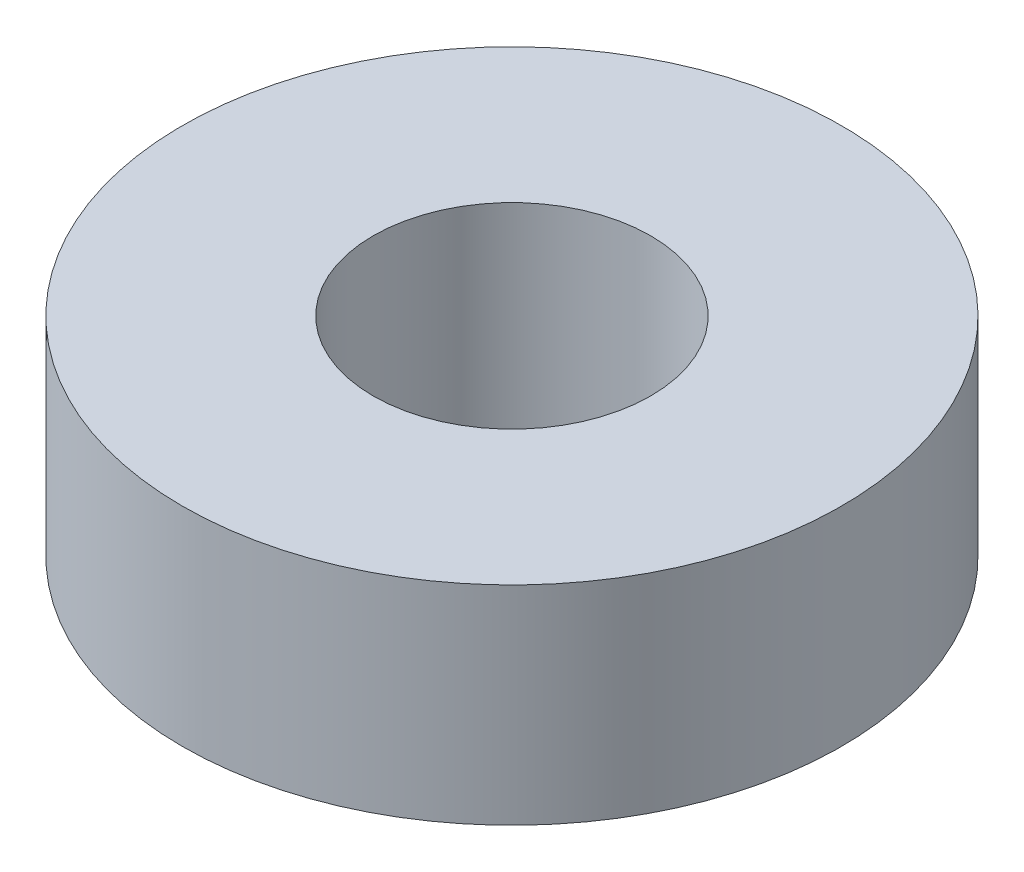
ISO-10303-21;
HEADER;
FILE_DESCRIPTION(('STEP AP214'),'2;1');
FILE_NAME('part.step','',(''),(''),'','','');
FILE_SCHEMA(('AUTOMOTIVE_DESIGN { 1 0 10303 214 1 1 1 1 }'));
ENDSEC;
DATA;
#1=APPLICATION_CONTEXT('core data for automotive mechanical design processes');
#2=APPLICATION_PROTOCOL_DEFINITION('international standard','automotive_design',2000,#1);
#3=PRODUCT_CONTEXT('',#1,'mechanical');
#4=PRODUCT('Part','Part','',(#3));
#5=PRODUCT_RELATED_PRODUCT_CATEGORY('part','',(#4));
#6=PRODUCT_DEFINITION_FORMATION('','',#4);
#7=PRODUCT_DEFINITION_CONTEXT('part definition',#1,'design');
#8=PRODUCT_DEFINITION('design','',#6,#7);
#9=PRODUCT_DEFINITION_SHAPE('','',#8);
#10=(LENGTH_UNIT() NAMED_UNIT(*) SI_UNIT(.MILLI.,.METRE.));
#11=(NAMED_UNIT(*) PLANE_ANGLE_UNIT() SI_UNIT($,.RADIAN.));
#12=(NAMED_UNIT(*) SI_UNIT($,.STERADIAN.) SOLID_ANGLE_UNIT());
#13=UNCERTAINTY_MEASURE_WITH_UNIT(LENGTH_MEASURE(1.E-05),#10,'distance_accuracy_value','');
#14=(GEOMETRIC_REPRESENTATION_CONTEXT(3) GLOBAL_UNCERTAINTY_ASSIGNED_CONTEXT((#13)) GLOBAL_UNIT_ASSIGNED_CONTEXT((#10,
#11,#12)) REPRESENTATION_CONTEXT('',''));
#15=CARTESIAN_POINT('',(0.,0.,0.));
#16=DIRECTION('',(0.,0.,1.));
#17=DIRECTION('',(1.,0.,0.));
#18=AXIS2_PLACEMENT_3D('',#15,#16,#17);
#19=CARTESIAN_POINT('',(0.,6.,0.));
#20=DIRECTION('',(0.,1.,0.));
#21=DIRECTION('',(0.,0.,1.));
#22=AXIS2_PLACEMENT_3D('',#19,#20,#21);
#23=PLANE('',#22);
#24=CARTESIAN_POINT('',(0.,6.,0.));
#25=DIRECTION('',(0.,1.,0.));
#26=DIRECTION('',(0.,0.,1.));
#27=AXIS2_PLACEMENT_3D('',#24,#25,#26);
#28=CIRCLE('',#27,9.5);
#29=CARTESIAN_POINT('',(0.,6.,9.5));
#30=VERTEX_POINT('',#29);
#31=EDGE_CURVE('E10',#30,#30,#28,.T.);
#32=ORIENTED_EDGE('',*,*,#31,.T.);
#33=EDGE_LOOP('',(#32));
#34=FACE_BOUND('',#33,.T.);
#35=CARTESIAN_POINT('',(0.,6.,0.));
#36=DIRECTION('',(0.,1.,0.));
#37=DIRECTION('',(0.,0.,1.));
#38=AXIS2_PLACEMENT_3D('',#35,#36,#37);
#39=CIRCLE('',#38,4.);
#40=CARTESIAN_POINT('',(0.,6.,4.));
#41=VERTEX_POINT('',#40);
#42=EDGE_CURVE('E44',#41,#41,#39,.T.);
#43=ORIENTED_EDGE('',*,*,#42,.F.);
#44=EDGE_LOOP('',(#43));
#45=FACE_BOUND('',#44,.T.);
#46=ADVANCED_FACE('F33',(#34,#45),#23,.T.);
#47=CARTESIAN_POINT('',(0.,0.,0.));
#48=DIRECTION('',(0.,1.,0.));
#49=DIRECTION('',(0.,0.,1.));
#50=AXIS2_PLACEMENT_3D('',#47,#48,#49);
#51=PLANE('',#50);
#52=CARTESIAN_POINT('',(0.,0.,0.));
#53=DIRECTION('',(0.,1.,0.));
#54=DIRECTION('',(0.,0.,1.));
#55=AXIS2_PLACEMENT_3D('',#52,#53,#54);
#56=CIRCLE('',#55,9.5);
#57=CARTESIAN_POINT('',(0.,0.,9.5));
#58=VERTEX_POINT('',#57);
#59=EDGE_CURVE('E37',#58,#58,#56,.T.);
#60=ORIENTED_EDGE('',*,*,#59,.F.);
#61=EDGE_LOOP('',(#60));
#62=FACE_BOUND('',#61,.T.);
#63=CARTESIAN_POINT('',(0.,0.,0.));
#64=DIRECTION('',(0.,1.,0.));
#65=DIRECTION('',(0.,0.,1.));
#66=AXIS2_PLACEMENT_3D('',#63,#64,#65);
#67=CIRCLE('',#66,4.);
#68=CARTESIAN_POINT('',(0.,0.,4.));
#69=VERTEX_POINT('',#68);
#70=EDGE_CURVE('E46',#69,#69,#67,.T.);
#71=ORIENTED_EDGE('',*,*,#70,.T.);
#72=EDGE_LOOP('',(#71));
#73=FACE_BOUND('',#72,.T.);
#74=ADVANCED_FACE('F56',(#62,#73),#51,.F.);
#75=CARTESIAN_POINT('',(0.,6.,0.));
#76=DIRECTION('',(0.,-1.,0.));
#77=DIRECTION('',(0.,0.,-1.));
#78=AXIS2_PLACEMENT_3D('',#75,#76,#77);
#79=CYLINDRICAL_SURFACE('',#78,9.5);
#80=ORIENTED_EDGE('',*,*,#31,.F.);
#81=EDGE_LOOP('',(#80));
#82=FACE_BOUND('',#81,.T.);
#83=ORIENTED_EDGE('',*,*,#59,.T.);
#84=EDGE_LOOP('',(#83));
#85=FACE_BOUND('',#84,.T.);
#86=ADVANCED_FACE('F35',(#82,#85),#79,.T.);
#87=CARTESIAN_POINT('',(0.,6.,0.));
#88=DIRECTION('',(0.,-1.,0.));
#89=DIRECTION('',(0.,0.,-1.));
#90=AXIS2_PLACEMENT_3D('',#87,#88,#89);
#91=CYLINDRICAL_SURFACE('',#90,4.);
#92=ORIENTED_EDGE('',*,*,#42,.T.);
#93=EDGE_LOOP('',(#92));
#94=FACE_BOUND('',#93,.T.);
#95=ORIENTED_EDGE('',*,*,#70,.F.);
#96=EDGE_LOOP('',(#95));
#97=FACE_BOUND('',#96,.T.);
#98=ADVANCED_FACE('F52',(#94,#97),#91,.F.);
#99=CLOSED_SHELL('',(#46,#74,#86,#98));
#100=MANIFOLD_SOLID_BREP('B2',#99);
#101=ADVANCED_BREP_SHAPE_REPRESENTATION('',(#18,#100),#14);
#102=SHAPE_DEFINITION_REPRESENTATION(#9,#101);
ENDSEC;
END-ISO-10303-21;
